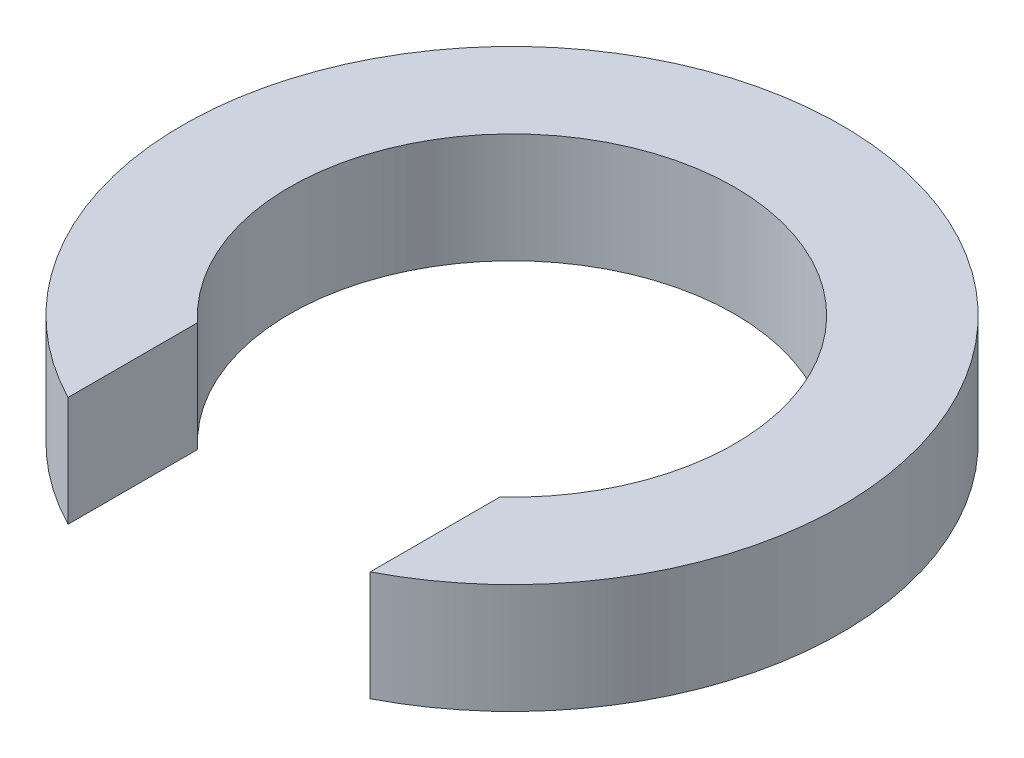
ISO-10303-21;
HEADER;
FILE_DESCRIPTION(('STEP AP214'),'2;1');
FILE_NAME('part.step','',(''),(''),'','','');
FILE_SCHEMA(('AUTOMOTIVE_DESIGN { 1 0 10303 214 1 1 1 1 }'));
ENDSEC;
DATA;
#1=APPLICATION_CONTEXT('core data for automotive mechanical design processes');
#2=APPLICATION_PROTOCOL_DEFINITION('international standard','automotive_design',2000,#1);
#3=PRODUCT_CONTEXT('',#1,'mechanical');
#4=PRODUCT('Part','Part','',(#3));
#5=PRODUCT_RELATED_PRODUCT_CATEGORY('part','',(#4));
#6=PRODUCT_DEFINITION_FORMATION('','',#4);
#7=PRODUCT_DEFINITION_CONTEXT('part definition',#1,'design');
#8=PRODUCT_DEFINITION('design','',#6,#7);
#9=PRODUCT_DEFINITION_SHAPE('','',#8);
#10=(LENGTH_UNIT() NAMED_UNIT(*) SI_UNIT(.MILLI.,.METRE.));
#11=(NAMED_UNIT(*) PLANE_ANGLE_UNIT() SI_UNIT($,.RADIAN.));
#12=(NAMED_UNIT(*) SI_UNIT($,.STERADIAN.) SOLID_ANGLE_UNIT());
#13=UNCERTAINTY_MEASURE_WITH_UNIT(LENGTH_MEASURE(1.E-05),#10,'distance_accuracy_value','');
#14=(GEOMETRIC_REPRESENTATION_CONTEXT(3) GLOBAL_UNCERTAINTY_ASSIGNED_CONTEXT((#13)) GLOBAL_UNIT_ASSIGNED_CONTEXT((#10,
#11,#12)) REPRESENTATION_CONTEXT('',''));
#15=CARTESIAN_POINT('',(0.,0.,0.));
#16=DIRECTION('',(0.,0.,1.));
#17=DIRECTION('',(1.,0.,0.));
#18=AXIS2_PLACEMENT_3D('',#15,#16,#17);
#19=CARTESIAN_POINT('',(0.,2.,0.));
#20=DIRECTION('',(0.,-1.,0.));
#21=DIRECTION('',(0.,0.,-1.));
#22=AXIS2_PLACEMENT_3D('',#19,#20,#21);
#23=CYLINDRICAL_SURFACE('',#22,4.05);
#24=CARTESIAN_POINT('',(0.,0.,0.));
#25=DIRECTION('',(0.,-1.,0.));
#26=DIRECTION('',(0.,0.,1.));
#27=AXIS2_PLACEMENT_3D('',#24,#25,#26);
#28=CIRCLE('',#27,4.05);
#29=CARTESIAN_POINT('',(-2.75,0.,2.9732137494637));
#30=VERTEX_POINT('',#29);
#31=CARTESIAN_POINT('',(2.75,0.,2.9732137494637));
#32=VERTEX_POINT('',#31);
#33=EDGE_CURVE('E113',#30,#32,#28,.T.);
#34=ORIENTED_EDGE('',*,*,#33,.T.);
#35=DIRECTION('',(0.,-1.,0.));
#36=VECTOR('',#35,1.);
#37=CARTESIAN_POINT('',(2.75,2.,2.9732137494637));
#38=LINE('',#37,#36);
#39=CARTESIAN_POINT('',(2.75,2.,2.9732137494637));
#40=VERTEX_POINT('',#39);
#41=EDGE_CURVE('E11',#40,#32,#38,.T.);
#42=ORIENTED_EDGE('',*,*,#41,.F.);
#43=CARTESIAN_POINT('',(0.,2.,0.));
#44=DIRECTION('',(0.,-1.,0.));
#45=DIRECTION('',(0.,0.,1.));
#46=AXIS2_PLACEMENT_3D('',#43,#44,#45);
#47=CIRCLE('',#46,4.05);
#48=CARTESIAN_POINT('',(-2.75,2.,2.9732137494637));
#49=VERTEX_POINT('',#48);
#50=EDGE_CURVE('E97',#49,#40,#47,.T.);
#51=ORIENTED_EDGE('',*,*,#50,.F.);
#52=DIRECTION('',(0.,-1.,0.));
#53=VECTOR('',#52,1.);
#54=CARTESIAN_POINT('',(-2.75,2.,2.9732137494637));
#55=LINE('',#54,#53);
#56=EDGE_CURVE('E109',#49,#30,#55,.T.);
#57=ORIENTED_EDGE('',*,*,#56,.T.);
#58=EDGE_LOOP('',(#34,#42,#51,#57));
#59=FACE_BOUND('',#58,.T.);
#60=ADVANCED_FACE('F45',(#59),#23,.F.);
#61=CARTESIAN_POINT('',(2.75,2.,2.9732137494637));
#62=DIRECTION('',(1.,0.,0.));
#63=DIRECTION('',(0.,0.,-1.));
#64=AXIS2_PLACEMENT_3D('',#61,#62,#63);
#65=PLANE('',#64);
#66=DIRECTION('',(0.,0.,1.));
#67=VECTOR('',#66,1.);
#68=CARTESIAN_POINT('',(2.75,0.,2.9732137494637));
#69=LINE('',#68,#67);
#70=CARTESIAN_POINT('',(2.75,0.,5.33268225192538));
#71=VERTEX_POINT('',#70);
#72=EDGE_CURVE('E102',#32,#71,#69,.T.);
#73=ORIENTED_EDGE('',*,*,#72,.T.);
#74=DIRECTION('',(0.,-1.,0.));
#75=VECTOR('',#74,1.);
#76=CARTESIAN_POINT('',(2.75,2.,5.33268225192538));
#77=LINE('',#76,#75);
#78=CARTESIAN_POINT('',(2.75,2.,5.33268225192538));
#79=VERTEX_POINT('',#78);
#80=EDGE_CURVE('E54',#79,#71,#77,.T.);
#81=ORIENTED_EDGE('',*,*,#80,.F.);
#82=DIRECTION('',(0.,0.,1.));
#83=VECTOR('',#82,1.);
#84=CARTESIAN_POINT('',(2.75,2.,2.9732137494637));
#85=LINE('',#84,#83);
#86=EDGE_CURVE('E92',#40,#79,#85,.T.);
#87=ORIENTED_EDGE('',*,*,#86,.F.);
#88=ORIENTED_EDGE('',*,*,#41,.T.);
#89=EDGE_LOOP('',(#73,#81,#87,#88));
#90=FACE_BOUND('',#89,.T.);
#91=ADVANCED_FACE('F101',(#90),#65,.F.);
#92=CARTESIAN_POINT('',(0.,2.,0.));
#93=DIRECTION('',(0.,-1.,0.));
#94=DIRECTION('',(0.,0.,-1.));
#95=AXIS2_PLACEMENT_3D('',#92,#93,#94);
#96=CYLINDRICAL_SURFACE('',#95,6.);
#97=CARTESIAN_POINT('',(0.,0.,0.));
#98=DIRECTION('',(0.,1.,0.));
#99=DIRECTION('',(0.,0.,1.));
#100=AXIS2_PLACEMENT_3D('',#97,#98,#99);
#101=CIRCLE('',#100,6.);
#102=CARTESIAN_POINT('',(-2.75,0.,5.33268225192539));
#103=VERTEX_POINT('',#102);
#104=EDGE_CURVE('E79',#71,#103,#101,.T.);
#105=ORIENTED_EDGE('',*,*,#104,.T.);
#106=DIRECTION('',(0.,-1.,0.));
#107=VECTOR('',#106,1.);
#108=CARTESIAN_POINT('',(-2.75,2.,5.33268225192539));
#109=LINE('',#108,#107);
#110=CARTESIAN_POINT('',(-2.75,2.,5.33268225192539));
#111=VERTEX_POINT('',#110);
#112=EDGE_CURVE('E104',#111,#103,#109,.T.);
#113=ORIENTED_EDGE('',*,*,#112,.F.);
#114=CARTESIAN_POINT('',(0.,2.,0.));
#115=DIRECTION('',(0.,1.,0.));
#116=DIRECTION('',(0.,0.,1.));
#117=AXIS2_PLACEMENT_3D('',#114,#115,#116);
#118=CIRCLE('',#117,6.);
#119=EDGE_CURVE('E95',#79,#111,#118,.T.);
#120=ORIENTED_EDGE('',*,*,#119,.F.);
#121=ORIENTED_EDGE('',*,*,#80,.T.);
#122=EDGE_LOOP('',(#105,#113,#120,#121));
#123=FACE_BOUND('',#122,.T.);
#124=ADVANCED_FACE('F105',(#123),#96,.T.);
#125=CARTESIAN_POINT('',(-2.75,2.,2.9732137494637));
#126=DIRECTION('',(-1.,0.,0.));
#127=DIRECTION('',(0.,0.,1.));
#128=AXIS2_PLACEMENT_3D('',#125,#126,#127);
#129=PLANE('',#128);
#130=DIRECTION('',(0.,0.,-1.));
#131=VECTOR('',#130,1.);
#132=CARTESIAN_POINT('',(-2.75,0.,2.9732137494637));
#133=LINE('',#132,#131);
#134=EDGE_CURVE('E85',#103,#30,#133,.T.);
#135=ORIENTED_EDGE('',*,*,#134,.T.);
#136=ORIENTED_EDGE('',*,*,#56,.F.);
#137=DIRECTION('',(0.,0.,-1.));
#138=VECTOR('',#137,1.);
#139=CARTESIAN_POINT('',(-2.75,2.,2.9732137494637));
#140=LINE('',#139,#138);
#141=EDGE_CURVE('E62',#111,#49,#140,.T.);
#142=ORIENTED_EDGE('',*,*,#141,.F.);
#143=ORIENTED_EDGE('',*,*,#112,.T.);
#144=EDGE_LOOP('',(#135,#136,#142,#143));
#145=FACE_BOUND('',#144,.T.);
#146=ADVANCED_FACE('F126',(#145),#129,.F.);
#147=CARTESIAN_POINT('',(0.,2.,0.));
#148=DIRECTION('',(0.,1.,0.));
#149=DIRECTION('',(0.,0.,1.));
#150=AXIS2_PLACEMENT_3D('',#147,#148,#149);
#151=PLANE('',#150);
#152=ORIENTED_EDGE('',*,*,#50,.T.);
#153=ORIENTED_EDGE('',*,*,#86,.T.);
#154=ORIENTED_EDGE('',*,*,#119,.T.);
#155=ORIENTED_EDGE('',*,*,#141,.T.);
#156=EDGE_LOOP('',(#152,#153,#154,#155));
#157=FACE_BOUND('',#156,.T.);
#158=ADVANCED_FACE('F93',(#157),#151,.T.);
#159=CARTESIAN_POINT('',(0.,0.,0.));
#160=DIRECTION('',(0.,1.,0.));
#161=DIRECTION('',(0.,0.,1.));
#162=AXIS2_PLACEMENT_3D('',#159,#160,#161);
#163=PLANE('',#162);
#164=ORIENTED_EDGE('',*,*,#33,.F.);
#165=ORIENTED_EDGE('',*,*,#134,.F.);
#166=ORIENTED_EDGE('',*,*,#104,.F.);
#167=ORIENTED_EDGE('',*,*,#72,.F.);
#168=EDGE_LOOP('',(#164,#165,#166,#167));
#169=FACE_BOUND('',#168,.T.);
#170=ADVANCED_FACE('F129',(#169),#163,.F.);
#171=CLOSED_SHELL('',(#60,#91,#124,#146,#158,#170));
#172=MANIFOLD_SOLID_BREP('B2',#171);
#173=ADVANCED_BREP_SHAPE_REPRESENTATION('',(#18,#172),#14);
#174=SHAPE_DEFINITION_REPRESENTATION(#9,#173);
ENDSEC;
END-ISO-10303-21;
